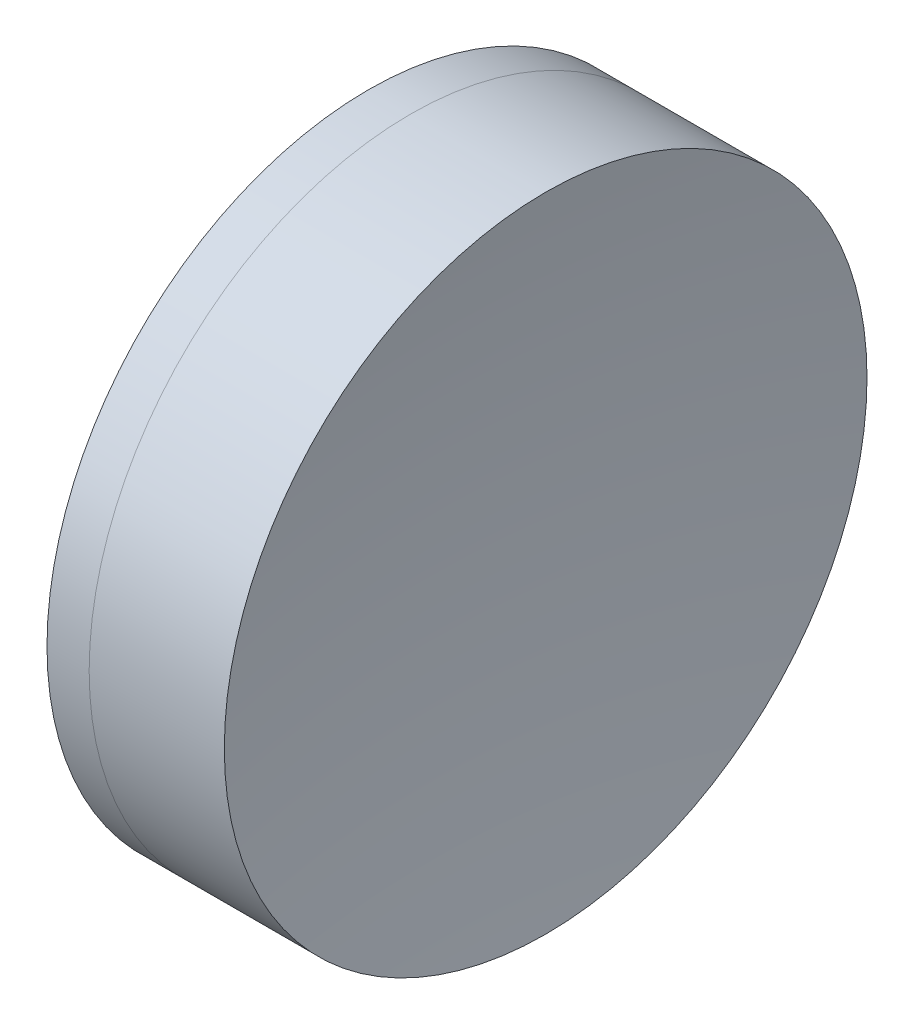
ISO-10303-21;
HEADER;
FILE_DESCRIPTION(('STEP AP214'),'2;1');
FILE_NAME('part.step','',(''),(''),'','','');
FILE_SCHEMA(('AUTOMOTIVE_DESIGN { 1 0 10303 214 1 1 1 1 }'));
ENDSEC;
DATA;
#1=APPLICATION_CONTEXT('core data for automotive mechanical design processes');
#2=APPLICATION_PROTOCOL_DEFINITION('international standard','automotive_design',2000,#1);
#3=PRODUCT_CONTEXT('',#1,'mechanical');
#4=PRODUCT('Part','Part','',(#3));
#5=PRODUCT_RELATED_PRODUCT_CATEGORY('part','',(#4));
#6=PRODUCT_DEFINITION_FORMATION('','',#4);
#7=PRODUCT_DEFINITION_CONTEXT('part definition',#1,'design');
#8=PRODUCT_DEFINITION('design','',#6,#7);
#9=PRODUCT_DEFINITION_SHAPE('','',#8);
#10=(LENGTH_UNIT() NAMED_UNIT(*) SI_UNIT(.MILLI.,.METRE.));
#11=(NAMED_UNIT(*) PLANE_ANGLE_UNIT() SI_UNIT($,.RADIAN.));
#12=(NAMED_UNIT(*) SI_UNIT($,.STERADIAN.) SOLID_ANGLE_UNIT());
#13=UNCERTAINTY_MEASURE_WITH_UNIT(LENGTH_MEASURE(1.E-05),#10,'distance_accuracy_value','');
#14=(GEOMETRIC_REPRESENTATION_CONTEXT(3) GLOBAL_UNCERTAINTY_ASSIGNED_CONTEXT((#13)) GLOBAL_UNIT_ASSIGNED_CONTEXT((#10,
#11,#12)) REPRESENTATION_CONTEXT('',''));
#15=CARTESIAN_POINT('',(0.,0.,0.));
#16=DIRECTION('',(0.,0.,1.));
#17=DIRECTION('',(1.,0.,0.));
#18=AXIS2_PLACEMENT_3D('',#15,#16,#17);
#19=CARTESIAN_POINT('',(64.214883839049,0.,0.));
#20=DIRECTION('',(-1.,0.,0.));
#21=DIRECTION('',(0.,0.,1.));
#22=AXIS2_PLACEMENT_3D('',#19,#20,#21);
#23=SPHERICAL_SURFACE('',#22,39.17);
#24=CARTESIAN_POINT('',(100.398981174757,0.,0.));
#25=DIRECTION('',(-1.,0.,0.));
#26=DIRECTION('',(0.,0.,1.));
#27=AXIS2_PLACEMENT_3D('',#24,#25,#26);
#28=CIRCLE('',#27,15.);
#29=CARTESIAN_POINT('',(100.398981174757,0.,15.));
#30=VERTEX_POINT('',#29);
#31=EDGE_CURVE('E51',#30,#30,#28,.T.);
#32=ORIENTED_EDGE('',*,*,#31,.T.);
#33=EDGE_LOOP('',(#32));
#34=FACE_BOUND('',#33,.T.);
#35=ADVANCED_FACE('F45',(#34),#23,.F.);
#36=CARTESIAN_POINT('',(206.274883839049,0.,0.));
#37=DIRECTION('',(-1.,0.,0.));
#38=DIRECTION('',(0.,0.,-1.));
#39=AXIS2_PLACEMENT_3D('',#36,#37,#38);
#40=SPHERICAL_SURFACE('',#39,100.69);
#41=CARTESIAN_POINT('',(106.70844320768,0.,0.));
#42=DIRECTION('',(-1.,0.,0.));
#43=DIRECTION('',(0.,0.,1.));
#44=AXIS2_PLACEMENT_3D('',#41,#42,#43);
#45=CIRCLE('',#44,15.);
#46=CARTESIAN_POINT('',(106.70844320768,0.,15.));
#47=VERTEX_POINT('',#46);
#48=EDGE_CURVE('E11',#47,#47,#45,.T.);
#49=ORIENTED_EDGE('',*,*,#48,.F.);
#50=EDGE_LOOP('',(#49));
#51=FACE_BOUND('',#50,.T.);
#52=ADVANCED_FACE('F60',(#51),#40,.F.);
#53=CARTESIAN_POINT('',(-0.551919992657797,0.,0.));
#54=DIRECTION('',(-1.,0.,0.));
#55=DIRECTION('',(0.,0.,1.));
#56=AXIS2_PLACEMENT_3D('',#53,#54,#55);
#57=CYLINDRICAL_SURFACE('',#56,15.);
#58=ORIENTED_EDGE('',*,*,#48,.T.);
#59=EDGE_LOOP('',(#58));
#60=FACE_BOUND('',#59,.T.);
#61=ORIENTED_EDGE('',*,*,#31,.F.);
#62=EDGE_LOOP('',(#61));
#63=FACE_BOUND('',#62,.T.);
#64=ADVANCED_FACE('F58',(#60,#63),#57,.T.);
#65=CLOSED_SHELL('',(#35,#52,#64));
#66=MANIFOLD_SOLID_BREP('B2',#65);
#67=CARTESIAN_POINT('',(128.384883839049,0.,0.));
#68=DIRECTION('',(-1.,0.,0.));
#69=DIRECTION('',(0.,0.,1.));
#70=AXIS2_PLACEMENT_3D('',#67,#68,#69);
#71=SPHERICAL_SURFACE('',#70,33.5);
#72=CARTESIAN_POINT('',(98.4307522375487,0.,0.));
#73=DIRECTION('',(-1.,0.,0.));
#74=DIRECTION('',(0.,0.,1.));
#75=AXIS2_PLACEMENT_3D('',#72,#73,#74);
#76=CIRCLE('',#75,15.);
#77=CARTESIAN_POINT('',(98.4307522375487,0.,15.));
#78=VERTEX_POINT('',#77);
#79=EDGE_CURVE('E44',#78,#78,#76,.T.);
#80=ORIENTED_EDGE('',*,*,#79,.T.);
#81=EDGE_LOOP('',(#80));
#82=FACE_BOUND('',#81,.T.);
#83=ADVANCED_FACE('F86',(#82),#71,.T.);
#84=CARTESIAN_POINT('',(-0.816062176165804,0.,0.));
#85=DIRECTION('',(-1.,0.,0.));
#86=DIRECTION('',(0.,0.,1.));
#87=AXIS2_PLACEMENT_3D('',#84,#85,#86);
#88=CYLINDRICAL_SURFACE('',#87,15.);
#89=CARTESIAN_POINT('',(100.398981174757,0.,0.));
#90=DIRECTION('',(-1.,0.,0.));
#91=DIRECTION('',(0.,0.,1.));
#92=AXIS2_PLACEMENT_3D('',#89,#90,#91);
#93=CIRCLE('',#92,15.);
#94=CARTESIAN_POINT('',(100.398981174757,0.,15.));
#95=VERTEX_POINT('',#94);
#96=EDGE_CURVE('E92',#95,#95,#93,.T.);
#97=ORIENTED_EDGE('',*,*,#96,.T.);
#98=EDGE_LOOP('',(#97));
#99=FACE_BOUND('',#98,.T.);
#100=ORIENTED_EDGE('',*,*,#79,.F.);
#101=EDGE_LOOP('',(#100));
#102=FACE_BOUND('',#101,.T.);
#103=ADVANCED_FACE('F98',(#99,#102),#88,.T.);
#104=CARTESIAN_POINT('',(64.214883839049,0.,0.));
#105=DIRECTION('',(-1.,0.,0.));
#106=DIRECTION('',(0.,0.,1.));
#107=AXIS2_PLACEMENT_3D('',#104,#105,#106);
#108=SPHERICAL_SURFACE('',#107,39.17);
#109=ORIENTED_EDGE('',*,*,#96,.F.);
#110=EDGE_LOOP('',(#109));
#111=FACE_BOUND('',#110,.T.);
#112=ADVANCED_FACE('F101',(#111),#108,.T.);
#113=CLOSED_SHELL('',(#83,#103,#112));
#114=MANIFOLD_SOLID_BREP('B6',#113);
#115=ADVANCED_BREP_SHAPE_REPRESENTATION('',(#18,#66,#114),#14);
#116=SHAPE_DEFINITION_REPRESENTATION(#9,#115);
ENDSEC;
END-ISO-10303-21;
